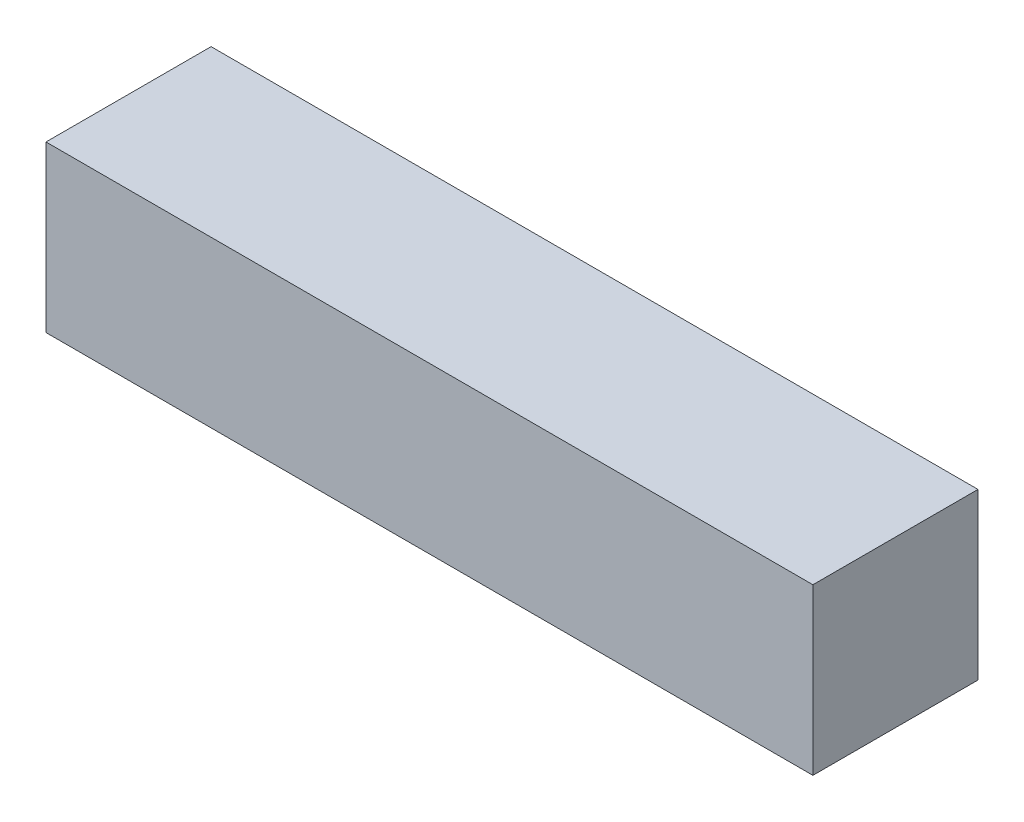
ISO-10303-21;
HEADER;
FILE_DESCRIPTION(('STEP AP214'),'2;1');
FILE_NAME('part.step','',(''),(''),'','','');
FILE_SCHEMA(('AUTOMOTIVE_DESIGN { 1 0 10303 214 1 1 1 1 }'));
ENDSEC;
DATA;
#1=APPLICATION_CONTEXT('core data for automotive mechanical design processes');
#2=APPLICATION_PROTOCOL_DEFINITION('international standard','automotive_design',2000,#1);
#3=PRODUCT_CONTEXT('',#1,'mechanical');
#4=PRODUCT('Part','Part','',(#3));
#5=PRODUCT_RELATED_PRODUCT_CATEGORY('part','',(#4));
#6=PRODUCT_DEFINITION_FORMATION('','',#4);
#7=PRODUCT_DEFINITION_CONTEXT('part definition',#1,'design');
#8=PRODUCT_DEFINITION('design','',#6,#7);
#9=PRODUCT_DEFINITION_SHAPE('','',#8);
#10=(LENGTH_UNIT() NAMED_UNIT(*) SI_UNIT(.MILLI.,.METRE.));
#11=(NAMED_UNIT(*) PLANE_ANGLE_UNIT() SI_UNIT($,.RADIAN.));
#12=(NAMED_UNIT(*) SI_UNIT($,.STERADIAN.) SOLID_ANGLE_UNIT());
#13=UNCERTAINTY_MEASURE_WITH_UNIT(LENGTH_MEASURE(1.E-05),#10,'distance_accuracy_value','');
#14=(GEOMETRIC_REPRESENTATION_CONTEXT(3) GLOBAL_UNCERTAINTY_ASSIGNED_CONTEXT((#13)) GLOBAL_UNIT_ASSIGNED_CONTEXT((#10,
#11,#12)) REPRESENTATION_CONTEXT('',''));
#15=CARTESIAN_POINT('',(0.,0.,0.));
#16=DIRECTION('',(0.,0.,1.));
#17=DIRECTION('',(1.,0.,0.));
#18=AXIS2_PLACEMENT_3D('',#15,#16,#17);
#19=CARTESIAN_POINT('',(7.2,-1.55,-1.55));
#20=DIRECTION('',(0.,0.,1.));
#21=DIRECTION('',(1.,0.,0.));
#22=AXIS2_PLACEMENT_3D('',#19,#20,#21);
#23=PLANE('',#22);
#24=DIRECTION('',(0.,1.,0.));
#25=VECTOR('',#24,1.);
#26=CARTESIAN_POINT('',(-7.2,-1.55,-1.55));
#27=LINE('',#26,#25);
#28=CARTESIAN_POINT('',(-7.2,-1.55,-1.55));
#29=VERTEX_POINT('',#28);
#30=CARTESIAN_POINT('',(-7.2,1.55,-1.55));
#31=VERTEX_POINT('',#30);
#32=EDGE_CURVE('E101',#29,#31,#27,.T.);
#33=ORIENTED_EDGE('',*,*,#32,.T.);
#34=DIRECTION('',(-1.,0.,0.));
#35=VECTOR('',#34,1.);
#36=CARTESIAN_POINT('',(7.2,1.55,-1.55));
#37=LINE('',#36,#35);
#38=CARTESIAN_POINT('',(7.2,1.55,-1.55));
#39=VERTEX_POINT('',#38);
#40=EDGE_CURVE('E11',#39,#31,#37,.T.);
#41=ORIENTED_EDGE('',*,*,#40,.F.);
#42=DIRECTION('',(0.,1.,0.));
#43=VECTOR('',#42,1.);
#44=CARTESIAN_POINT('',(7.2,-1.55,-1.55));
#45=LINE('',#44,#43);
#46=CARTESIAN_POINT('',(7.2,-1.55,-1.55));
#47=VERTEX_POINT('',#46);
#48=EDGE_CURVE('E89',#47,#39,#45,.T.);
#49=ORIENTED_EDGE('',*,*,#48,.F.);
#50=DIRECTION('',(-1.,0.,0.));
#51=VECTOR('',#50,1.);
#52=CARTESIAN_POINT('',(7.2,-1.55,-1.55));
#53=LINE('',#52,#51);
#54=EDGE_CURVE('E97',#47,#29,#53,.T.);
#55=ORIENTED_EDGE('',*,*,#54,.T.);
#56=EDGE_LOOP('',(#33,#41,#49,#55));
#57=FACE_BOUND('',#56,.T.);
#58=ADVANCED_FACE('F38',(#57),#23,.F.);
#59=CARTESIAN_POINT('',(7.2,1.55,1.55));
#60=DIRECTION('',(0.,-1.,0.));
#61=DIRECTION('',(0.,0.,-1.));
#62=AXIS2_PLACEMENT_3D('',#59,#60,#61);
#63=PLANE('',#62);
#64=DIRECTION('',(0.,0.,1.));
#65=VECTOR('',#64,1.);
#66=CARTESIAN_POINT('',(-7.2,1.55,1.55));
#67=LINE('',#66,#65);
#68=CARTESIAN_POINT('',(-7.2,1.55,1.55));
#69=VERTEX_POINT('',#68);
#70=EDGE_CURVE('E93',#31,#69,#67,.T.);
#71=ORIENTED_EDGE('',*,*,#70,.T.);
#72=DIRECTION('',(-1.,0.,0.));
#73=VECTOR('',#72,1.);
#74=CARTESIAN_POINT('',(7.2,1.55,1.55));
#75=LINE('',#74,#73);
#76=CARTESIAN_POINT('',(7.2,1.55,1.55));
#77=VERTEX_POINT('',#76);
#78=EDGE_CURVE('E46',#77,#69,#75,.T.);
#79=ORIENTED_EDGE('',*,*,#78,.F.);
#80=DIRECTION('',(0.,0.,1.));
#81=VECTOR('',#80,1.);
#82=CARTESIAN_POINT('',(7.2,1.55,1.55));
#83=LINE('',#82,#81);
#84=EDGE_CURVE('E84',#39,#77,#83,.T.);
#85=ORIENTED_EDGE('',*,*,#84,.F.);
#86=ORIENTED_EDGE('',*,*,#40,.T.);
#87=EDGE_LOOP('',(#71,#79,#85,#86));
#88=FACE_BOUND('',#87,.T.);
#89=ADVANCED_FACE('F92',(#88),#63,.F.);
#90=CARTESIAN_POINT('',(7.2,-1.55,1.55));
#91=DIRECTION('',(0.,0.,-1.));
#92=DIRECTION('',(-1.,0.,0.));
#93=AXIS2_PLACEMENT_3D('',#90,#91,#92);
#94=PLANE('',#93);
#95=DIRECTION('',(0.,-1.,0.));
#96=VECTOR('',#95,1.);
#97=CARTESIAN_POINT('',(-7.2,-1.55,1.55));
#98=LINE('',#97,#96);
#99=CARTESIAN_POINT('',(-7.2,-1.55,1.55));
#100=VERTEX_POINT('',#99);
#101=EDGE_CURVE('E71',#69,#100,#98,.T.);
#102=ORIENTED_EDGE('',*,*,#101,.T.);
#103=DIRECTION('',(-1.,0.,0.));
#104=VECTOR('',#103,1.);
#105=CARTESIAN_POINT('',(7.2,-1.55,1.55));
#106=LINE('',#105,#104);
#107=CARTESIAN_POINT('',(7.2,-1.55,1.55));
#108=VERTEX_POINT('',#107);
#109=EDGE_CURVE('E94',#108,#100,#106,.T.);
#110=ORIENTED_EDGE('',*,*,#109,.F.);
#111=DIRECTION('',(0.,-1.,0.));
#112=VECTOR('',#111,1.);
#113=CARTESIAN_POINT('',(7.2,-1.55,1.55));
#114=LINE('',#113,#112);
#115=EDGE_CURVE('E87',#77,#108,#114,.T.);
#116=ORIENTED_EDGE('',*,*,#115,.F.);
#117=ORIENTED_EDGE('',*,*,#78,.T.);
#118=EDGE_LOOP('',(#102,#110,#116,#117));
#119=FACE_BOUND('',#118,.T.);
#120=ADVANCED_FACE('F95',(#119),#94,.F.);
#121=CARTESIAN_POINT('',(7.2,-1.55,1.55));
#122=DIRECTION('',(0.,1.,0.));
#123=DIRECTION('',(0.,0.,1.));
#124=AXIS2_PLACEMENT_3D('',#121,#122,#123);
#125=PLANE('',#124);
#126=DIRECTION('',(0.,0.,-1.));
#127=VECTOR('',#126,1.);
#128=CARTESIAN_POINT('',(-7.2,-1.55,1.55));
#129=LINE('',#128,#127);
#130=EDGE_CURVE('E77',#100,#29,#129,.T.);
#131=ORIENTED_EDGE('',*,*,#130,.T.);
#132=ORIENTED_EDGE('',*,*,#54,.F.);
#133=DIRECTION('',(0.,0.,-1.));
#134=VECTOR('',#133,1.);
#135=CARTESIAN_POINT('',(7.2,-1.55,1.55));
#136=LINE('',#135,#134);
#137=EDGE_CURVE('E54',#108,#47,#136,.T.);
#138=ORIENTED_EDGE('',*,*,#137,.F.);
#139=ORIENTED_EDGE('',*,*,#109,.T.);
#140=EDGE_LOOP('',(#131,#132,#138,#139));
#141=FACE_BOUND('',#140,.T.);
#142=ADVANCED_FACE('F108',(#141),#125,.F.);
#143=CARTESIAN_POINT('',(7.2,0.,0.));
#144=DIRECTION('',(-1.,0.,0.));
#145=DIRECTION('',(0.,0.,1.));
#146=AXIS2_PLACEMENT_3D('',#143,#144,#145);
#147=PLANE('',#146);
#148=ORIENTED_EDGE('',*,*,#48,.T.);
#149=ORIENTED_EDGE('',*,*,#84,.T.);
#150=ORIENTED_EDGE('',*,*,#115,.T.);
#151=ORIENTED_EDGE('',*,*,#137,.T.);
#152=EDGE_LOOP('',(#148,#149,#150,#151));
#153=FACE_BOUND('',#152,.T.);
#154=ADVANCED_FACE('F85',(#153),#147,.F.);
#155=CARTESIAN_POINT('',(-7.2,0.,0.));
#156=DIRECTION('',(-1.,0.,0.));
#157=DIRECTION('',(0.,0.,1.));
#158=AXIS2_PLACEMENT_3D('',#155,#156,#157);
#159=PLANE('',#158);
#160=ORIENTED_EDGE('',*,*,#32,.F.);
#161=ORIENTED_EDGE('',*,*,#130,.F.);
#162=ORIENTED_EDGE('',*,*,#101,.F.);
#163=ORIENTED_EDGE('',*,*,#70,.F.);
#164=EDGE_LOOP('',(#160,#161,#162,#163));
#165=FACE_BOUND('',#164,.T.);
#166=ADVANCED_FACE('F111',(#165),#159,.T.);
#167=CLOSED_SHELL('',(#58,#89,#120,#142,#154,#166));
#168=MANIFOLD_SOLID_BREP('B2',#167);
#169=ADVANCED_BREP_SHAPE_REPRESENTATION('',(#18,#168),#14);
#170=SHAPE_DEFINITION_REPRESENTATION(#9,#169);
ENDSEC;
END-ISO-10303-21;
